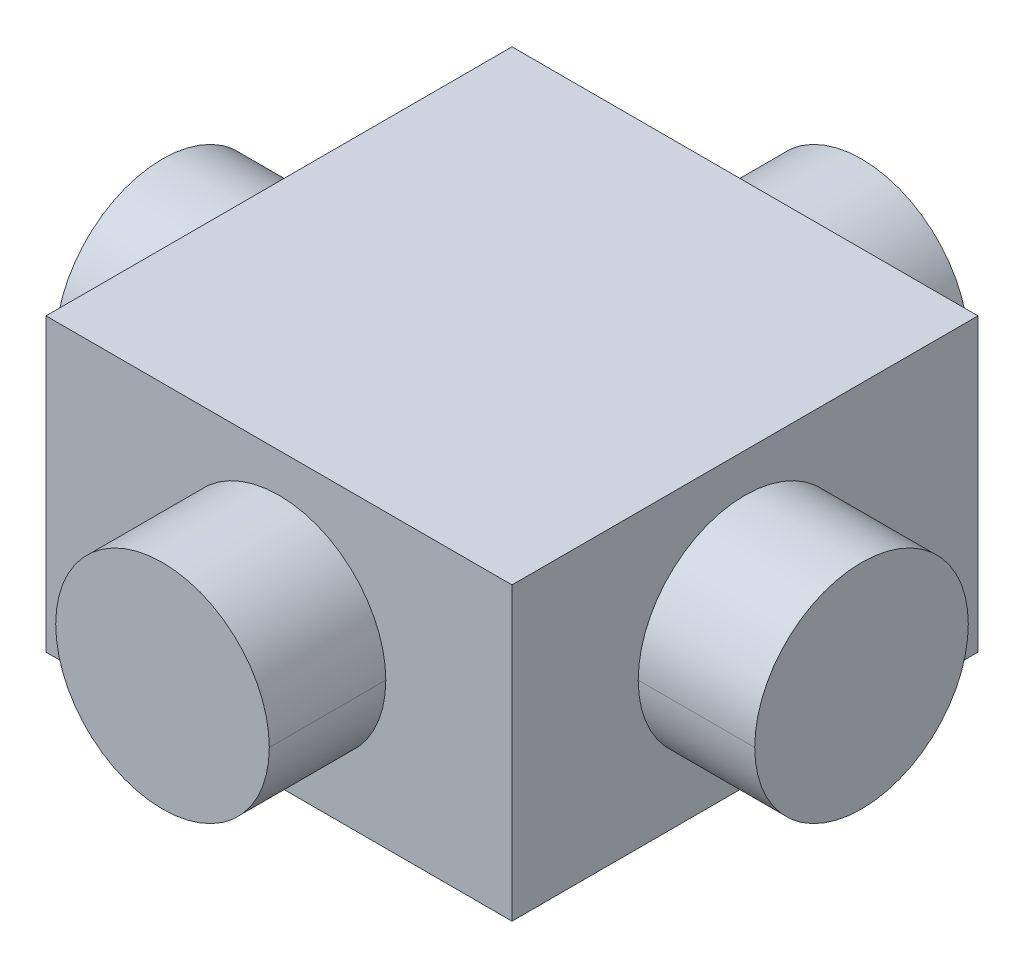
ISO-10303-21;
HEADER;
FILE_DESCRIPTION(('STEP AP214'),'2;1');
FILE_NAME('part.step','',(''),(''),'','','');
FILE_SCHEMA(('AUTOMOTIVE_DESIGN { 1 0 10303 214 1 1 1 1 }'));
ENDSEC;
DATA;
#1=APPLICATION_CONTEXT('core data for automotive mechanical design processes');
#2=APPLICATION_PROTOCOL_DEFINITION('international standard','automotive_design',2000,#1);
#3=PRODUCT_CONTEXT('',#1,'mechanical');
#4=PRODUCT('Part','Part','',(#3));
#5=PRODUCT_RELATED_PRODUCT_CATEGORY('part','',(#4));
#6=PRODUCT_DEFINITION_FORMATION('','',#4);
#7=PRODUCT_DEFINITION_CONTEXT('part definition',#1,'design');
#8=PRODUCT_DEFINITION('design','',#6,#7);
#9=PRODUCT_DEFINITION_SHAPE('','',#8);
#10=(LENGTH_UNIT() NAMED_UNIT(*) SI_UNIT(.MILLI.,.METRE.));
#11=(NAMED_UNIT(*) PLANE_ANGLE_UNIT() SI_UNIT($,.RADIAN.));
#12=(NAMED_UNIT(*) SI_UNIT($,.STERADIAN.) SOLID_ANGLE_UNIT());
#13=UNCERTAINTY_MEASURE_WITH_UNIT(LENGTH_MEASURE(1.E-05),#10,'distance_accuracy_value','');
#14=(GEOMETRIC_REPRESENTATION_CONTEXT(3) GLOBAL_UNCERTAINTY_ASSIGNED_CONTEXT((#13)) GLOBAL_UNIT_ASSIGNED_CONTEXT((#10,
#11,#12)) REPRESENTATION_CONTEXT('',''));
#15=CARTESIAN_POINT('',(0.,0.,0.));
#16=DIRECTION('',(0.,0.,1.));
#17=DIRECTION('',(1.,0.,0.));
#18=AXIS2_PLACEMENT_3D('',#15,#16,#17);
#19=CARTESIAN_POINT('',(3.6,0.,0.));
#20=DIRECTION('',(-1.,0.,0.));
#21=DIRECTION('',(0.,0.,1.));
#22=AXIS2_PLACEMENT_3D('',#19,#20,#21);
#23=CYLINDRICAL_SURFACE('',#22,1.1);
#24=DIRECTION('',(-1.,0.,0.));
#25=VECTOR('',#24,1.);
#26=CARTESIAN_POINT('',(3.6,0.,-1.10000000000001));
#27=LINE('',#26,#25);
#28=CARTESIAN_POINT('',(-2.4,0.,-1.1));
#29=VERTEX_POINT('',#28);
#30=CARTESIAN_POINT('',(-3.6,0.,-1.09999999999999));
#31=VERTEX_POINT('',#30);
#32=EDGE_CURVE('E187',#29,#31,#27,.T.);
#33=ORIENTED_EDGE('',*,*,#32,.F.);
#34=CARTESIAN_POINT('',(-2.4,0.,0.));
#35=DIRECTION('',(-1.,0.,0.));
#36=DIRECTION('',(0.,0.,1.));
#37=AXIS2_PLACEMENT_3D('',#34,#35,#36);
#38=CIRCLE('',#37,1.1);
#39=CARTESIAN_POINT('',(-2.4,0.,1.1));
#40=VERTEX_POINT('',#39);
#41=EDGE_CURVE('E183',#29,#40,#38,.T.);
#42=ORIENTED_EDGE('',*,*,#41,.T.);
#43=DIRECTION('',(-1.,0.,0.));
#44=VECTOR('',#43,1.);
#45=CARTESIAN_POINT('',(3.6,0.,1.09999999999999));
#46=LINE('',#45,#44);
#47=CARTESIAN_POINT('',(-3.6,0.,1.10000000000001));
#48=VERTEX_POINT('',#47);
#49=EDGE_CURVE('E206',#40,#48,#46,.T.);
#50=ORIENTED_EDGE('',*,*,#49,.T.);
#51=CARTESIAN_POINT('',(-3.6,0.,0.));
#52=DIRECTION('',(1.,0.,0.));
#53=DIRECTION('',(0.,0.,-1.));
#54=AXIS2_PLACEMENT_3D('',#51,#52,#53);
#55=CIRCLE('',#54,1.1);
#56=EDGE_CURVE('E11',#48,#31,#55,.T.);
#57=ORIENTED_EDGE('',*,*,#56,.T.);
#58=EDGE_LOOP('',(#33,#42,#50,#57));
#59=FACE_BOUND('',#58,.T.);
#60=ADVANCED_FACE('F17',(#59),#23,.T.);
#61=CARTESIAN_POINT('',(-3.6,0.,0.));
#62=DIRECTION('',(1.,0.,0.));
#63=DIRECTION('',(0.,0.,-1.));
#64=AXIS2_PLACEMENT_3D('',#61,#62,#63);
#65=PLANE('',#64);
#66=ORIENTED_EDGE('',*,*,#56,.F.);
#67=CARTESIAN_POINT('',(-3.6,0.,0.));
#68=DIRECTION('',(1.,0.,0.));
#69=DIRECTION('',(0.,0.,-1.));
#70=AXIS2_PLACEMENT_3D('',#67,#68,#69);
#71=CIRCLE('',#70,1.1);
#72=EDGE_CURVE('E190',#31,#48,#71,.T.);
#73=ORIENTED_EDGE('',*,*,#72,.F.);
#74=EDGE_LOOP('',(#66,#73));
#75=FACE_BOUND('',#74,.T.);
#76=ADVANCED_FACE('F311',(#75),#65,.F.);
#77=CARTESIAN_POINT('',(0.,0.,3.6));
#78=DIRECTION('',(0.,0.,-1.));
#79=DIRECTION('',(-1.,0.,0.));
#80=AXIS2_PLACEMENT_3D('',#77,#78,#79);
#81=CYLINDRICAL_SURFACE('',#80,1.1);
#82=DIRECTION('',(0.,0.,-1.));
#83=VECTOR('',#82,1.);
#84=CARTESIAN_POINT('',(1.1,0.,3.6));
#85=LINE('',#84,#83);
#86=CARTESIAN_POINT('',(1.1,0.,-2.4));
#87=VERTEX_POINT('',#86);
#88=CARTESIAN_POINT('',(1.1,0.,-3.6));
#89=VERTEX_POINT('',#88);
#90=EDGE_CURVE('E218',#87,#89,#85,.T.);
#91=ORIENTED_EDGE('',*,*,#90,.F.);
#92=CARTESIAN_POINT('',(0.,0.,-2.4));
#93=DIRECTION('',(0.,0.,1.));
#94=DIRECTION('',(1.,0.,0.));
#95=AXIS2_PLACEMENT_3D('',#92,#93,#94);
#96=CIRCLE('',#95,1.1);
#97=CARTESIAN_POINT('',(-1.1,0.,-2.4));
#98=VERTEX_POINT('',#97);
#99=EDGE_CURVE('E186',#98,#87,#96,.T.);
#100=ORIENTED_EDGE('',*,*,#99,.F.);
#101=DIRECTION('',(0.,0.,-1.));
#102=VECTOR('',#101,1.);
#103=CARTESIAN_POINT('',(-1.1,0.,3.6));
#104=LINE('',#103,#102);
#105=CARTESIAN_POINT('',(-1.1,0.,-3.6));
#106=VERTEX_POINT('',#105);
#107=EDGE_CURVE('E217',#98,#106,#104,.T.);
#108=ORIENTED_EDGE('',*,*,#107,.T.);
#109=CARTESIAN_POINT('',(0.,0.,-3.6));
#110=DIRECTION('',(0.,0.,1.));
#111=DIRECTION('',(1.,0.,0.));
#112=AXIS2_PLACEMENT_3D('',#109,#110,#111);
#113=CIRCLE('',#112,1.1);
#114=EDGE_CURVE('E28',#106,#89,#113,.T.);
#115=ORIENTED_EDGE('',*,*,#114,.T.);
#116=EDGE_LOOP('',(#91,#100,#108,#115));
#117=FACE_BOUND('',#116,.T.);
#118=ADVANCED_FACE('F19',(#117),#81,.T.);
#119=CARTESIAN_POINT('',(0.,0.,-3.6));
#120=DIRECTION('',(0.,0.,1.));
#121=DIRECTION('',(1.,0.,0.));
#122=AXIS2_PLACEMENT_3D('',#119,#120,#121);
#123=PLANE('',#122);
#124=ORIENTED_EDGE('',*,*,#114,.F.);
#125=CARTESIAN_POINT('',(0.,0.,-3.6));
#126=DIRECTION('',(0.,0.,1.));
#127=DIRECTION('',(1.,0.,0.));
#128=AXIS2_PLACEMENT_3D('',#125,#126,#127);
#129=CIRCLE('',#128,1.1);
#130=EDGE_CURVE('E214',#89,#106,#129,.T.);
#131=ORIENTED_EDGE('',*,*,#130,.F.);
#132=EDGE_LOOP('',(#124,#131));
#133=FACE_BOUND('',#132,.T.);
#134=ADVANCED_FACE('F306',(#133),#123,.F.);
#135=CARTESIAN_POINT('',(3.6,0.,0.));
#136=DIRECTION('',(-1.,0.,0.));
#137=DIRECTION('',(0.,0.,1.));
#138=AXIS2_PLACEMENT_3D('',#135,#136,#137);
#139=CYLINDRICAL_SURFACE('',#138,1.1);
#140=DIRECTION('',(-1.,0.,0.));
#141=VECTOR('',#140,1.);
#142=CARTESIAN_POINT('',(3.6,0.,-1.10000000000001));
#143=LINE('',#142,#141);
#144=CARTESIAN_POINT('',(3.6,0.,-1.10000000000001));
#145=VERTEX_POINT('',#144);
#146=CARTESIAN_POINT('',(2.4,0.,-1.1));
#147=VERTEX_POINT('',#146);
#148=EDGE_CURVE('E246',#145,#147,#143,.T.);
#149=ORIENTED_EDGE('',*,*,#148,.F.);
#150=CARTESIAN_POINT('',(3.6,0.,0.));
#151=DIRECTION('',(1.,0.,0.));
#152=DIRECTION('',(0.,0.,-1.));
#153=AXIS2_PLACEMENT_3D('',#150,#151,#152);
#154=CIRCLE('',#153,1.1);
#155=CARTESIAN_POINT('',(3.6,0.,1.09999999999999));
#156=VERTEX_POINT('',#155);
#157=EDGE_CURVE('E180',#156,#145,#154,.T.);
#158=ORIENTED_EDGE('',*,*,#157,.F.);
#159=DIRECTION('',(-1.,0.,0.));
#160=VECTOR('',#159,1.);
#161=CARTESIAN_POINT('',(3.6,0.,1.09999999999999));
#162=LINE('',#161,#160);
#163=CARTESIAN_POINT('',(2.4,0.,1.1));
#164=VERTEX_POINT('',#163);
#165=EDGE_CURVE('E21',#156,#164,#162,.T.);
#166=ORIENTED_EDGE('',*,*,#165,.T.);
#167=CARTESIAN_POINT('',(2.4,0.,0.));
#168=DIRECTION('',(-1.,0.,0.));
#169=DIRECTION('',(0.,0.,1.));
#170=AXIS2_PLACEMENT_3D('',#167,#168,#169);
#171=CIRCLE('',#170,1.1);
#172=EDGE_CURVE('E150',#147,#164,#171,.T.);
#173=ORIENTED_EDGE('',*,*,#172,.F.);
#174=EDGE_LOOP('',(#149,#158,#166,#173));
#175=FACE_BOUND('',#174,.T.);
#176=ADVANCED_FACE('F291',(#175),#139,.T.);
#177=CARTESIAN_POINT('',(3.6,0.,0.));
#178=DIRECTION('',(1.,0.,0.));
#179=DIRECTION('',(0.,0.,-1.));
#180=AXIS2_PLACEMENT_3D('',#177,#178,#179);
#181=PLANE('',#180);
#182=ORIENTED_EDGE('',*,*,#157,.T.);
#183=CARTESIAN_POINT('',(3.6,0.,0.));
#184=DIRECTION('',(1.,0.,0.));
#185=DIRECTION('',(0.,0.,-1.));
#186=AXIS2_PLACEMENT_3D('',#183,#184,#185);
#187=CIRCLE('',#186,1.1);
#188=EDGE_CURVE('E251',#145,#156,#187,.T.);
#189=ORIENTED_EDGE('',*,*,#188,.T.);
#190=EDGE_LOOP('',(#182,#189));
#191=FACE_BOUND('',#190,.T.);
#192=ADVANCED_FACE('F296',(#191),#181,.T.);
#193=CARTESIAN_POINT('',(0.,-1.5,0.));
#194=DIRECTION('',(0.,1.,0.));
#195=DIRECTION('',(1.,0.,0.));
#196=AXIS2_PLACEMENT_3D('',#193,#194,#195);
#197=PLANE('',#196);
#198=DIRECTION('',(-1.,0.,0.));
#199=VECTOR('',#198,1.);
#200=CARTESIAN_POINT('',(0.,-1.5,2.4));
#201=LINE('',#200,#199);
#202=CARTESIAN_POINT('',(2.4,-1.5,2.4));
#203=VERTEX_POINT('',#202);
#204=CARTESIAN_POINT('',(-2.4,-1.5,2.4));
#205=VERTEX_POINT('',#204);
#206=EDGE_CURVE('E179',#203,#205,#201,.T.);
#207=ORIENTED_EDGE('',*,*,#206,.T.);
#208=DIRECTION('',(0.,0.,-1.));
#209=VECTOR('',#208,1.);
#210=CARTESIAN_POINT('',(-2.4,-1.5,0.));
#211=LINE('',#210,#209);
#212=CARTESIAN_POINT('',(-2.4,-1.5,-2.4));
#213=VERTEX_POINT('',#212);
#214=EDGE_CURVE('E145',#205,#213,#211,.T.);
#215=ORIENTED_EDGE('',*,*,#214,.T.);
#216=DIRECTION('',(-1.,0.,0.));
#217=VECTOR('',#216,1.);
#218=CARTESIAN_POINT('',(0.,-1.5,-2.4));
#219=LINE('',#218,#217);
#220=CARTESIAN_POINT('',(2.4,-1.5,-2.4));
#221=VERTEX_POINT('',#220);
#222=EDGE_CURVE('E138',#221,#213,#219,.T.);
#223=ORIENTED_EDGE('',*,*,#222,.F.);
#224=DIRECTION('',(0.,0.,-1.));
#225=VECTOR('',#224,1.);
#226=CARTESIAN_POINT('',(2.4,-1.5,0.));
#227=LINE('',#226,#225);
#228=EDGE_CURVE('E143',#203,#221,#227,.T.);
#229=ORIENTED_EDGE('',*,*,#228,.F.);
#230=EDGE_LOOP('',(#207,#215,#223,#229));
#231=FACE_BOUND('',#230,.T.);
#232=ADVANCED_FACE('F141',(#231),#197,.F.);
#233=CARTESIAN_POINT('',(0.,1.5,0.));
#234=DIRECTION('',(0.,1.,0.));
#235=DIRECTION('',(1.,0.,0.));
#236=AXIS2_PLACEMENT_3D('',#233,#234,#235);
#237=PLANE('',#236);
#238=DIRECTION('',(-1.,0.,0.));
#239=VECTOR('',#238,1.);
#240=CARTESIAN_POINT('',(0.,1.5,2.4));
#241=LINE('',#240,#239);
#242=CARTESIAN_POINT('',(2.4,1.5,2.4));
#243=VERTEX_POINT('',#242);
#244=CARTESIAN_POINT('',(-2.4,1.5,2.4));
#245=VERTEX_POINT('',#244);
#246=EDGE_CURVE('E173',#243,#245,#241,.T.);
#247=ORIENTED_EDGE('',*,*,#246,.F.);
#248=DIRECTION('',(0.,0.,-1.));
#249=VECTOR('',#248,1.);
#250=CARTESIAN_POINT('',(2.4,1.5,0.));
#251=LINE('',#250,#249);
#252=CARTESIAN_POINT('',(2.4,1.5,-2.4));
#253=VERTEX_POINT('',#252);
#254=EDGE_CURVE('E159',#243,#253,#251,.T.);
#255=ORIENTED_EDGE('',*,*,#254,.T.);
#256=DIRECTION('',(-1.,0.,0.));
#257=VECTOR('',#256,1.);
#258=CARTESIAN_POINT('',(0.,1.5,-2.4));
#259=LINE('',#258,#257);
#260=CARTESIAN_POINT('',(-2.4,1.5,-2.4));
#261=VERTEX_POINT('',#260);
#262=EDGE_CURVE('E155',#253,#261,#259,.T.);
#263=ORIENTED_EDGE('',*,*,#262,.T.);
#264=DIRECTION('',(0.,0.,-1.));
#265=VECTOR('',#264,1.);
#266=CARTESIAN_POINT('',(-2.4,1.5,0.));
#267=LINE('',#266,#265);
#268=EDGE_CURVE('E43',#245,#261,#267,.T.);
#269=ORIENTED_EDGE('',*,*,#268,.F.);
#270=EDGE_LOOP('',(#247,#255,#263,#269));
#271=FACE_BOUND('',#270,.T.);
#272=ADVANCED_FACE('F304',(#271),#237,.T.);
#273=CARTESIAN_POINT('',(-2.4,1.5,0.));
#274=DIRECTION('',(-1.,0.,0.));
#275=DIRECTION('',(0.,0.,1.));
#276=AXIS2_PLACEMENT_3D('',#273,#274,#275);
#277=PLANE('',#276);
#278=CARTESIAN_POINT('',(-2.4,0.,0.));
#279=DIRECTION('',(-1.,0.,0.));
#280=DIRECTION('',(0.,0.,1.));
#281=AXIS2_PLACEMENT_3D('',#278,#279,#280);
#282=CIRCLE('',#281,1.1);
#283=EDGE_CURVE('E191',#40,#29,#282,.T.);
#284=ORIENTED_EDGE('',*,*,#283,.F.);
#285=ORIENTED_EDGE('',*,*,#41,.F.);
#286=EDGE_LOOP('',(#284,#285));
#287=FACE_BOUND('',#286,.T.);
#288=ORIENTED_EDGE('',*,*,#214,.F.);
#289=DIRECTION('',(0.,-1.,0.));
#290=VECTOR('',#289,1.);
#291=CARTESIAN_POINT('',(-2.4,1.5,2.4));
#292=LINE('',#291,#290);
#293=EDGE_CURVE('E166',#245,#205,#292,.T.);
#294=ORIENTED_EDGE('',*,*,#293,.F.);
#295=ORIENTED_EDGE('',*,*,#268,.T.);
#296=DIRECTION('',(0.,-1.,0.));
#297=VECTOR('',#296,1.);
#298=CARTESIAN_POINT('',(-2.4,1.5,-2.4));
#299=LINE('',#298,#297);
#300=EDGE_CURVE('E149',#261,#213,#299,.T.);
#301=ORIENTED_EDGE('',*,*,#300,.T.);
#302=EDGE_LOOP('',(#288,#294,#295,#301));
#303=FACE_BOUND('',#302,.T.);
#304=ADVANCED_FACE('F368',(#287,#303),#277,.T.);
#305=CARTESIAN_POINT('',(0.,1.5,-2.4));
#306=DIRECTION('',(0.,0.,1.));
#307=DIRECTION('',(1.,0.,0.));
#308=AXIS2_PLACEMENT_3D('',#305,#306,#307);
#309=PLANE('',#308);
#310=ORIENTED_EDGE('',*,*,#99,.T.);
#311=CARTESIAN_POINT('',(0.,0.,-2.4));
#312=DIRECTION('',(0.,0.,1.));
#313=DIRECTION('',(1.,0.,0.));
#314=AXIS2_PLACEMENT_3D('',#311,#312,#313);
#315=CIRCLE('',#314,1.1);
#316=EDGE_CURVE('E225',#87,#98,#315,.T.);
#317=ORIENTED_EDGE('',*,*,#316,.T.);
#318=EDGE_LOOP('',(#310,#317));
#319=FACE_BOUND('',#318,.T.);
#320=ORIENTED_EDGE('',*,*,#222,.T.);
#321=ORIENTED_EDGE('',*,*,#300,.F.);
#322=ORIENTED_EDGE('',*,*,#262,.F.);
#323=DIRECTION('',(0.,-1.,0.));
#324=VECTOR('',#323,1.);
#325=CARTESIAN_POINT('',(2.4,1.5,-2.4));
#326=LINE('',#325,#324);
#327=EDGE_CURVE('E153',#253,#221,#326,.T.);
#328=ORIENTED_EDGE('',*,*,#327,.T.);
#329=EDGE_LOOP('',(#320,#321,#322,#328));
#330=FACE_BOUND('',#329,.T.);
#331=ADVANCED_FACE('F154',(#319,#330),#309,.F.);
#332=CARTESIAN_POINT('',(2.4,1.5,0.));
#333=DIRECTION('',(-1.,0.,0.));
#334=DIRECTION('',(0.,0.,1.));
#335=AXIS2_PLACEMENT_3D('',#332,#333,#334);
#336=PLANE('',#335);
#337=CARTESIAN_POINT('',(2.4,0.,0.));
#338=DIRECTION('',(-1.,0.,0.));
#339=DIRECTION('',(0.,0.,1.));
#340=AXIS2_PLACEMENT_3D('',#337,#338,#339);
#341=CIRCLE('',#340,1.1);
#342=EDGE_CURVE('E250',#164,#147,#341,.T.);
#343=ORIENTED_EDGE('',*,*,#342,.T.);
#344=ORIENTED_EDGE('',*,*,#172,.T.);
#345=EDGE_LOOP('',(#343,#344));
#346=FACE_BOUND('',#345,.T.);
#347=ORIENTED_EDGE('',*,*,#228,.T.);
#348=ORIENTED_EDGE('',*,*,#327,.F.);
#349=ORIENTED_EDGE('',*,*,#254,.F.);
#350=DIRECTION('',(0.,-1.,0.));
#351=VECTOR('',#350,1.);
#352=CARTESIAN_POINT('',(2.4,1.5,2.4));
#353=LINE('',#352,#351);
#354=EDGE_CURVE('E163',#243,#203,#353,.T.);
#355=ORIENTED_EDGE('',*,*,#354,.T.);
#356=EDGE_LOOP('',(#347,#348,#349,#355));
#357=FACE_BOUND('',#356,.T.);
#358=ADVANCED_FACE('F161',(#346,#357),#336,.F.);
#359=CARTESIAN_POINT('',(0.,1.5,2.4));
#360=DIRECTION('',(0.,0.,1.));
#361=DIRECTION('',(1.,0.,0.));
#362=AXIS2_PLACEMENT_3D('',#359,#360,#361);
#363=PLANE('',#362);
#364=CARTESIAN_POINT('',(0.,0.,2.4));
#365=DIRECTION('',(0.,0.,1.));
#366=DIRECTION('',(1.,0.,0.));
#367=AXIS2_PLACEMENT_3D('',#364,#365,#366);
#368=CIRCLE('',#367,1.1);
#369=CARTESIAN_POINT('',(-1.1,0.,2.4));
#370=VERTEX_POINT('',#369);
#371=CARTESIAN_POINT('',(1.1,0.,2.4));
#372=VERTEX_POINT('',#371);
#373=EDGE_CURVE('E198',#370,#372,#368,.T.);
#374=ORIENTED_EDGE('',*,*,#373,.F.);
#375=CARTESIAN_POINT('',(0.,0.,2.4));
#376=DIRECTION('',(0.,0.,1.));
#377=DIRECTION('',(1.,0.,0.));
#378=AXIS2_PLACEMENT_3D('',#375,#376,#377);
#379=CIRCLE('',#378,1.1);
#380=EDGE_CURVE('E229',#372,#370,#379,.T.);
#381=ORIENTED_EDGE('',*,*,#380,.F.);
#382=EDGE_LOOP('',(#374,#381));
#383=FACE_BOUND('',#382,.T.);
#384=ORIENTED_EDGE('',*,*,#206,.F.);
#385=ORIENTED_EDGE('',*,*,#354,.F.);
#386=ORIENTED_EDGE('',*,*,#246,.T.);
#387=ORIENTED_EDGE('',*,*,#293,.T.);
#388=EDGE_LOOP('',(#384,#385,#386,#387));
#389=FACE_BOUND('',#388,.T.);
#390=ADVANCED_FACE('F339',(#383,#389),#363,.T.);
#391=CARTESIAN_POINT('',(0.,0.,3.6));
#392=DIRECTION('',(0.,0.,1.));
#393=DIRECTION('',(1.,0.,0.));
#394=AXIS2_PLACEMENT_3D('',#391,#392,#393);
#395=PLANE('',#394);
#396=CARTESIAN_POINT('',(0.,0.,3.6));
#397=DIRECTION('',(0.,0.,1.));
#398=DIRECTION('',(1.,0.,0.));
#399=AXIS2_PLACEMENT_3D('',#396,#397,#398);
#400=CIRCLE('',#399,1.1);
#401=CARTESIAN_POINT('',(-1.1,0.,3.6));
#402=VERTEX_POINT('',#401);
#403=CARTESIAN_POINT('',(1.1,0.,3.6));
#404=VERTEX_POINT('',#403);
#405=EDGE_CURVE('E195',#402,#404,#400,.T.);
#406=ORIENTED_EDGE('',*,*,#405,.T.);
#407=CARTESIAN_POINT('',(0.,0.,3.6));
#408=DIRECTION('',(0.,0.,1.));
#409=DIRECTION('',(1.,0.,0.));
#410=AXIS2_PLACEMENT_3D('',#407,#408,#409);
#411=CIRCLE('',#410,1.1);
#412=EDGE_CURVE('E209',#404,#402,#411,.T.);
#413=ORIENTED_EDGE('',*,*,#412,.T.);
#414=EDGE_LOOP('',(#406,#413));
#415=FACE_BOUND('',#414,.T.);
#416=ADVANCED_FACE('F331',(#415),#395,.T.);
#417=CARTESIAN_POINT('',(0.,0.,3.6));
#418=DIRECTION('',(0.,0.,-1.));
#419=DIRECTION('',(-1.,0.,0.));
#420=AXIS2_PLACEMENT_3D('',#417,#418,#419);
#421=CYLINDRICAL_SURFACE('',#420,1.1);
#422=DIRECTION('',(0.,0.,-1.));
#423=VECTOR('',#422,1.);
#424=CARTESIAN_POINT('',(1.1,0.,3.6));
#425=LINE('',#424,#423);
#426=EDGE_CURVE('E213',#404,#372,#425,.T.);
#427=ORIENTED_EDGE('',*,*,#426,.F.);
#428=ORIENTED_EDGE('',*,*,#405,.F.);
#429=DIRECTION('',(0.,0.,-1.));
#430=VECTOR('',#429,1.);
#431=CARTESIAN_POINT('',(-1.1,0.,3.6));
#432=LINE('',#431,#430);
#433=EDGE_CURVE('E199',#402,#370,#432,.T.);
#434=ORIENTED_EDGE('',*,*,#433,.T.);
#435=ORIENTED_EDGE('',*,*,#373,.T.);
#436=EDGE_LOOP('',(#427,#428,#434,#435));
#437=FACE_BOUND('',#436,.T.);
#438=ADVANCED_FACE('F328',(#437),#421,.T.);
#439=CARTESIAN_POINT('',(0.,0.,3.6));
#440=DIRECTION('',(0.,0.,-1.));
#441=DIRECTION('',(-1.,0.,0.));
#442=AXIS2_PLACEMENT_3D('',#439,#440,#441);
#443=CYLINDRICAL_SURFACE('',#442,1.1);
#444=ORIENTED_EDGE('',*,*,#412,.F.);
#445=ORIENTED_EDGE('',*,*,#426,.T.);
#446=ORIENTED_EDGE('',*,*,#380,.T.);
#447=ORIENTED_EDGE('',*,*,#433,.F.);
#448=EDGE_LOOP('',(#444,#445,#446,#447));
#449=FACE_BOUND('',#448,.T.);
#450=ADVANCED_FACE('F330',(#449),#443,.T.);
#451=CARTESIAN_POINT('',(3.6,0.,0.));
#452=DIRECTION('',(-1.,0.,0.));
#453=DIRECTION('',(0.,0.,1.));
#454=AXIS2_PLACEMENT_3D('',#451,#452,#453);
#455=CYLINDRICAL_SURFACE('',#454,1.1);
#456=ORIENTED_EDGE('',*,*,#188,.F.);
#457=ORIENTED_EDGE('',*,*,#148,.T.);
#458=ORIENTED_EDGE('',*,*,#342,.F.);
#459=ORIENTED_EDGE('',*,*,#165,.F.);
#460=EDGE_LOOP('',(#456,#457,#458,#459));
#461=FACE_BOUND('',#460,.T.);
#462=ADVANCED_FACE('F294',(#461),#455,.T.);
#463=CARTESIAN_POINT('',(0.,0.,3.6));
#464=DIRECTION('',(0.,0.,-1.));
#465=DIRECTION('',(-1.,0.,0.));
#466=AXIS2_PLACEMENT_3D('',#463,#464,#465);
#467=CYLINDRICAL_SURFACE('',#466,1.1);
#468=ORIENTED_EDGE('',*,*,#316,.F.);
#469=ORIENTED_EDGE('',*,*,#90,.T.);
#470=ORIENTED_EDGE('',*,*,#130,.T.);
#471=ORIENTED_EDGE('',*,*,#107,.F.);
#472=EDGE_LOOP('',(#468,#469,#470,#471));
#473=FACE_BOUND('',#472,.T.);
#474=ADVANCED_FACE('F326',(#473),#467,.T.);
#475=CARTESIAN_POINT('',(3.6,0.,0.));
#476=DIRECTION('',(-1.,0.,0.));
#477=DIRECTION('',(0.,0.,1.));
#478=AXIS2_PLACEMENT_3D('',#475,#476,#477);
#479=CYLINDRICAL_SURFACE('',#478,1.1);
#480=ORIENTED_EDGE('',*,*,#283,.T.);
#481=ORIENTED_EDGE('',*,*,#32,.T.);
#482=ORIENTED_EDGE('',*,*,#72,.T.);
#483=ORIENTED_EDGE('',*,*,#49,.F.);
#484=EDGE_LOOP('',(#480,#481,#482,#483));
#485=FACE_BOUND('',#484,.T.);
#486=ADVANCED_FACE('F323',(#485),#479,.T.);
#487=CLOSED_SHELL('',(#60,#76,#118,#134,#176,#192,#232,#272,#304,#331,#358,#390,#416,#438,#450,
#462,#474,#486));
#488=MANIFOLD_SOLID_BREP('B1',#487);
#489=ADVANCED_BREP_SHAPE_REPRESENTATION('',(#18,#488),#14);
#490=SHAPE_DEFINITION_REPRESENTATION(#9,#489);
ENDSEC;
END-ISO-10303-21;
